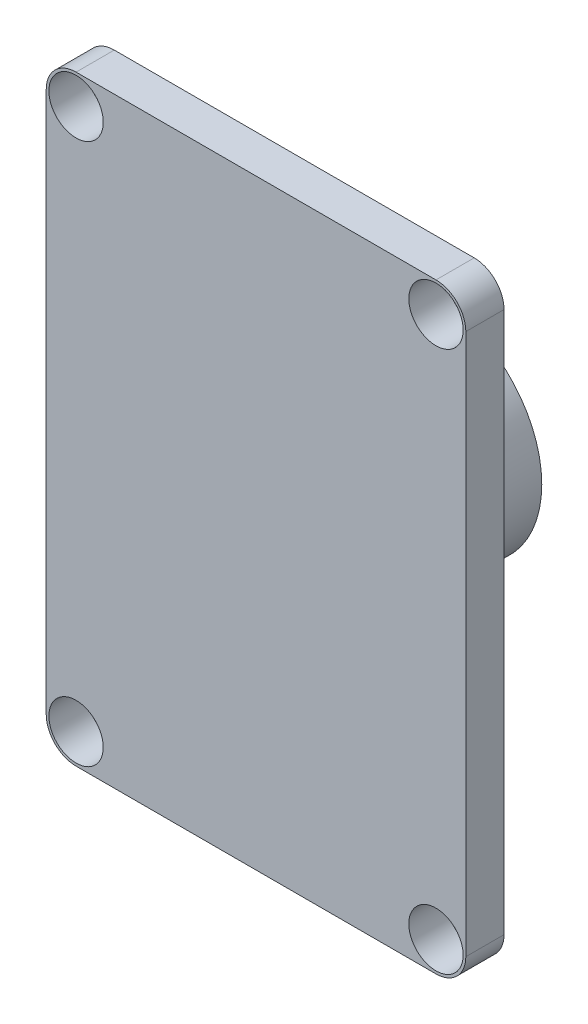
ISO-10303-21;
HEADER;
FILE_DESCRIPTION(('STEP AP214'),'2;1');
FILE_NAME('part.step','',(''),(''),'','','');
FILE_SCHEMA(('AUTOMOTIVE_DESIGN { 1 0 10303 214 1 1 1 1 }'));
ENDSEC;
DATA;
#1=APPLICATION_CONTEXT('core data for automotive mechanical design processes');
#2=APPLICATION_PROTOCOL_DEFINITION('international standard','automotive_design',2000,#1);
#3=PRODUCT_CONTEXT('',#1,'mechanical');
#4=PRODUCT('Part','Part','',(#3));
#5=PRODUCT_RELATED_PRODUCT_CATEGORY('part','',(#4));
#6=PRODUCT_DEFINITION_FORMATION('','',#4);
#7=PRODUCT_DEFINITION_CONTEXT('part definition',#1,'design');
#8=PRODUCT_DEFINITION('design','',#6,#7);
#9=PRODUCT_DEFINITION_SHAPE('','',#8);
#10=(LENGTH_UNIT() NAMED_UNIT(*) SI_UNIT(.MILLI.,.METRE.));
#11=(NAMED_UNIT(*) PLANE_ANGLE_UNIT() SI_UNIT($,.RADIAN.));
#12=(NAMED_UNIT(*) SI_UNIT($,.STERADIAN.) SOLID_ANGLE_UNIT());
#13=UNCERTAINTY_MEASURE_WITH_UNIT(LENGTH_MEASURE(1.E-05),#10,'distance_accuracy_value','');
#14=(GEOMETRIC_REPRESENTATION_CONTEXT(3) GLOBAL_UNCERTAINTY_ASSIGNED_CONTEXT((#13)) GLOBAL_UNIT_ASSIGNED_CONTEXT((#10,
#11,#12)) REPRESENTATION_CONTEXT('',''));
#15=CARTESIAN_POINT('',(0.,0.,0.));
#16=DIRECTION('',(0.,0.,1.));
#17=DIRECTION('',(1.,0.,0.));
#18=AXIS2_PLACEMENT_3D('',#15,#16,#17);
#19=CARTESIAN_POINT('',(-7.6581,-11.5189,1.6256));
#20=DIRECTION('',(0.,0.,-1.));
#21=DIRECTION('',(-1.,0.,0.));
#22=AXIS2_PLACEMENT_3D('',#19,#20,#21);
#23=PLANE('',#22);
#24=CARTESIAN_POINT('',(-7.6581,-11.5189,1.6256));
#25=DIRECTION('',(0.,0.,1.));
#26=DIRECTION('',(-1.,0.,0.));
#27=AXIS2_PLACEMENT_3D('',#24,#25,#26);
#28=CIRCLE('',#27,1.27);
#29=CARTESIAN_POINT('',(-8.9281,-11.5189,1.6256));
#30=VERTEX_POINT('',#29);
#31=CARTESIAN_POINT('',(-7.65809999999999,-12.7889,1.6256));
#32=VERTEX_POINT('',#31);
#33=EDGE_CURVE('E151',#30,#32,#28,.T.);
#34=ORIENTED_EDGE('',*,*,#33,.T.);
#35=DIRECTION('',(1.,0.,0.));
#36=VECTOR('',#35,1.);
#37=CARTESIAN_POINT('',(-7.65809999999999,-12.7889,1.6256));
#38=LINE('',#37,#36);
#39=CARTESIAN_POINT('',(7.65809999999999,-12.7889,1.6256));
#40=VERTEX_POINT('',#39);
#41=EDGE_CURVE('E99',#32,#40,#38,.T.);
#42=ORIENTED_EDGE('',*,*,#41,.T.);
#43=CARTESIAN_POINT('',(7.6581,-11.5189,1.6256));
#44=DIRECTION('',(0.,0.,1.));
#45=DIRECTION('',(-1.,0.,0.));
#46=AXIS2_PLACEMENT_3D('',#43,#44,#45);
#47=CIRCLE('',#46,1.27);
#48=CARTESIAN_POINT('',(8.9281,-11.5189,1.6256));
#49=VERTEX_POINT('',#48);
#50=EDGE_CURVE('E166',#40,#49,#47,.T.);
#51=ORIENTED_EDGE('',*,*,#50,.T.);
#52=DIRECTION('',(0.,1.,0.));
#53=VECTOR('',#52,1.);
#54=CARTESIAN_POINT('',(8.9281,-11.5189,1.6256));
#55=LINE('',#54,#53);
#56=CARTESIAN_POINT('',(8.9281,11.5189,1.6256));
#57=VERTEX_POINT('',#56);
#58=EDGE_CURVE('E179',#49,#57,#55,.T.);
#59=ORIENTED_EDGE('',*,*,#58,.T.);
#60=CARTESIAN_POINT('',(7.6581,11.5189,1.6256));
#61=DIRECTION('',(0.,0.,1.));
#62=DIRECTION('',(1.,0.,0.));
#63=AXIS2_PLACEMENT_3D('',#60,#61,#62);
#64=CIRCLE('',#63,1.27);
#65=CARTESIAN_POINT('',(7.65809999999999,12.7889,1.6256));
#66=VERTEX_POINT('',#65);
#67=EDGE_CURVE('E118',#57,#66,#64,.T.);
#68=ORIENTED_EDGE('',*,*,#67,.T.);
#69=DIRECTION('',(-1.,0.,0.));
#70=VECTOR('',#69,1.);
#71=CARTESIAN_POINT('',(-7.65809999999999,12.7889,1.6256));
#72=LINE('',#71,#70);
#73=CARTESIAN_POINT('',(-7.65809999999999,12.7889,1.6256));
#74=VERTEX_POINT('',#73);
#75=EDGE_CURVE('E112',#66,#74,#72,.T.);
#76=ORIENTED_EDGE('',*,*,#75,.T.);
#77=CARTESIAN_POINT('',(-7.6581,11.5189,1.6256));
#78=DIRECTION('',(0.,0.,1.));
#79=DIRECTION('',(1.,0.,0.));
#80=AXIS2_PLACEMENT_3D('',#77,#78,#79);
#81=CIRCLE('',#80,1.27);
#82=CARTESIAN_POINT('',(-8.9281,11.5189,1.6256));
#83=VERTEX_POINT('',#82);
#84=EDGE_CURVE('E116',#74,#83,#81,.T.);
#85=ORIENTED_EDGE('',*,*,#84,.T.);
#86=DIRECTION('',(0.,-1.,0.));
#87=VECTOR('',#86,1.);
#88=CARTESIAN_POINT('',(-8.9281,-11.5189,1.6256));
#89=LINE('',#88,#87);
#90=EDGE_CURVE('E56',#83,#30,#89,.T.);
#91=ORIENTED_EDGE('',*,*,#90,.T.);
#92=EDGE_LOOP('',(#34,#42,#51,#59,#68,#76,#85,#91));
#93=FACE_BOUND('',#92,.T.);
#94=CARTESIAN_POINT('',(7.6581,11.5189,1.6256));
#95=DIRECTION('',(0.,0.,1.));
#96=DIRECTION('',(1.,0.,0.));
#97=AXIS2_PLACEMENT_3D('',#94,#95,#96);
#98=CIRCLE('',#97,1.15640153633708);
#99=CARTESIAN_POINT('',(8.81450153633708,11.5189,1.6256));
#100=VERTEX_POINT('',#99);
#101=EDGE_CURVE('E140',#100,#100,#98,.T.);
#102=ORIENTED_EDGE('',*,*,#101,.F.);
#103=EDGE_LOOP('',(#102));
#104=FACE_BOUND('',#103,.T.);
#105=CARTESIAN_POINT('',(-7.6581,11.5189,1.6256));
#106=DIRECTION('',(0.,0.,1.));
#107=DIRECTION('',(-1.,0.,0.));
#108=AXIS2_PLACEMENT_3D('',#105,#106,#107);
#109=CIRCLE('',#108,1.15640153633708);
#110=CARTESIAN_POINT('',(-8.81450153633708,11.5189,1.6256));
#111=VERTEX_POINT('',#110);
#112=EDGE_CURVE('E188',#111,#111,#109,.T.);
#113=ORIENTED_EDGE('',*,*,#112,.F.);
#114=EDGE_LOOP('',(#113));
#115=FACE_BOUND('',#114,.T.);
#116=CARTESIAN_POINT('',(7.6581,-11.5189,1.6256));
#117=DIRECTION('',(0.,0.,1.));
#118=DIRECTION('',(-1.,0.,0.));
#119=AXIS2_PLACEMENT_3D('',#116,#117,#118);
#120=CIRCLE('',#119,1.15640153633709);
#121=CARTESIAN_POINT('',(6.50169846366292,-11.5189,1.6256));
#122=VERTEX_POINT('',#121);
#123=EDGE_CURVE('E194',#122,#122,#120,.T.);
#124=ORIENTED_EDGE('',*,*,#123,.F.);
#125=EDGE_LOOP('',(#124));
#126=FACE_BOUND('',#125,.T.);
#127=CARTESIAN_POINT('',(-7.6581,-11.5189,1.6256));
#128=DIRECTION('',(0.,0.,1.));
#129=DIRECTION('',(1.,0.,0.));
#130=AXIS2_PLACEMENT_3D('',#127,#128,#129);
#131=CIRCLE('',#130,1.15640153633708);
#132=CARTESIAN_POINT('',(-6.50169846366291,-11.5189,1.6256));
#133=VERTEX_POINT('',#132);
#134=EDGE_CURVE('E200',#133,#133,#131,.T.);
#135=ORIENTED_EDGE('',*,*,#134,.F.);
#136=EDGE_LOOP('',(#135));
#137=FACE_BOUND('',#136,.T.);
#138=ADVANCED_FACE('F39',(#93,#104,#115,#126,#137),#23,.F.);
#139=CARTESIAN_POINT('',(-7.6581,-11.5189,0.));
#140=DIRECTION('',(0.,0.,-1.));
#141=DIRECTION('',(-1.,0.,0.));
#142=AXIS2_PLACEMENT_3D('',#139,#140,#141);
#143=PLANE('',#142);
#144=CARTESIAN_POINT('',(0.,0.,0.));
#145=DIRECTION('',(0.,0.,-1.));
#146=DIRECTION('',(-1.,0.,0.));
#147=AXIS2_PLACEMENT_3D('',#144,#145,#146);
#148=CIRCLE('',#147,4.65455);
#149=CARTESIAN_POINT('',(-4.65455,0.,0.));
#150=VERTEX_POINT('',#149);
#151=EDGE_CURVE('E209',#150,#150,#148,.T.);
#152=ORIENTED_EDGE('',*,*,#151,.F.);
#153=EDGE_LOOP('',(#152));
#154=FACE_BOUND('',#153,.T.);
#155=CARTESIAN_POINT('',(7.6581,-11.5189,0.));
#156=DIRECTION('',(0.,0.,1.));
#157=DIRECTION('',(-1.,0.,0.));
#158=AXIS2_PLACEMENT_3D('',#155,#156,#157);
#159=CIRCLE('',#158,1.15640153633709);
#160=CARTESIAN_POINT('',(6.50169846366292,-11.5189,0.));
#161=VERTEX_POINT('',#160);
#162=EDGE_CURVE('E197',#161,#161,#159,.T.);
#163=ORIENTED_EDGE('',*,*,#162,.T.);
#164=EDGE_LOOP('',(#163));
#165=FACE_BOUND('',#164,.T.);
#166=CARTESIAN_POINT('',(7.6581,11.5189,0.));
#167=DIRECTION('',(0.,0.,1.));
#168=DIRECTION('',(1.,0.,0.));
#169=AXIS2_PLACEMENT_3D('',#166,#167,#168);
#170=CIRCLE('',#169,1.15640153633708);
#171=CARTESIAN_POINT('',(8.81450153633708,11.5189,0.));
#172=VERTEX_POINT('',#171);
#173=EDGE_CURVE('E185',#172,#172,#170,.T.);
#174=ORIENTED_EDGE('',*,*,#173,.T.);
#175=EDGE_LOOP('',(#174));
#176=FACE_BOUND('',#175,.T.);
#177=CARTESIAN_POINT('',(-7.6581,-11.5189,0.));
#178=DIRECTION('',(0.,0.,1.));
#179=DIRECTION('',(-1.,0.,0.));
#180=AXIS2_PLACEMENT_3D('',#177,#178,#179);
#181=CIRCLE('',#180,1.27);
#182=CARTESIAN_POINT('',(-8.9281,-11.5189,0.));
#183=VERTEX_POINT('',#182);
#184=CARTESIAN_POINT('',(-7.65809999999999,-12.7889,0.));
#185=VERTEX_POINT('',#184);
#186=EDGE_CURVE('E136',#183,#185,#181,.T.);
#187=ORIENTED_EDGE('',*,*,#186,.F.);
#188=DIRECTION('',(0.,-1.,0.));
#189=VECTOR('',#188,1.);
#190=CARTESIAN_POINT('',(-8.9281,-11.5189,0.));
#191=LINE('',#190,#189);
#192=CARTESIAN_POINT('',(-8.9281,11.5189,0.));
#193=VERTEX_POINT('',#192);
#194=EDGE_CURVE('E91',#193,#183,#191,.T.);
#195=ORIENTED_EDGE('',*,*,#194,.F.);
#196=CARTESIAN_POINT('',(-7.6581,11.5189,0.));
#197=DIRECTION('',(0.,0.,1.));
#198=DIRECTION('',(1.,0.,0.));
#199=AXIS2_PLACEMENT_3D('',#196,#197,#198);
#200=CIRCLE('',#199,1.27);
#201=CARTESIAN_POINT('',(-7.65809999999999,12.7889,0.));
#202=VERTEX_POINT('',#201);
#203=EDGE_CURVE('E85',#202,#193,#200,.T.);
#204=ORIENTED_EDGE('',*,*,#203,.F.);
#205=DIRECTION('',(-1.,0.,0.));
#206=VECTOR('',#205,1.);
#207=CARTESIAN_POINT('',(-7.65809999999999,12.7889,0.));
#208=LINE('',#207,#206);
#209=CARTESIAN_POINT('',(7.65809999999999,12.7889,0.));
#210=VERTEX_POINT('',#209);
#211=EDGE_CURVE('E126',#210,#202,#208,.T.);
#212=ORIENTED_EDGE('',*,*,#211,.F.);
#213=CARTESIAN_POINT('',(7.6581,11.5189,0.));
#214=DIRECTION('',(0.,0.,1.));
#215=DIRECTION('',(1.,0.,0.));
#216=AXIS2_PLACEMENT_3D('',#213,#214,#215);
#217=CIRCLE('',#216,1.27);
#218=CARTESIAN_POINT('',(8.9281,11.5189,0.));
#219=VERTEX_POINT('',#218);
#220=EDGE_CURVE('E146',#219,#210,#217,.T.);
#221=ORIENTED_EDGE('',*,*,#220,.F.);
#222=DIRECTION('',(0.,1.,0.));
#223=VECTOR('',#222,1.);
#224=CARTESIAN_POINT('',(8.9281,-11.5189,0.));
#225=LINE('',#224,#223);
#226=CARTESIAN_POINT('',(8.9281,-11.5189,0.));
#227=VERTEX_POINT('',#226);
#228=EDGE_CURVE('E144',#227,#219,#225,.T.);
#229=ORIENTED_EDGE('',*,*,#228,.F.);
#230=CARTESIAN_POINT('',(7.6581,-11.5189,0.));
#231=DIRECTION('',(0.,0.,1.));
#232=DIRECTION('',(-1.,0.,0.));
#233=AXIS2_PLACEMENT_3D('',#230,#231,#232);
#234=CIRCLE('',#233,1.27);
#235=CARTESIAN_POINT('',(7.65809999999999,-12.7889,0.));
#236=VERTEX_POINT('',#235);
#237=EDGE_CURVE('E142',#236,#227,#234,.T.);
#238=ORIENTED_EDGE('',*,*,#237,.F.);
#239=DIRECTION('',(1.,0.,0.));
#240=VECTOR('',#239,1.);
#241=CARTESIAN_POINT('',(-7.65809999999999,-12.7889,0.));
#242=LINE('',#241,#240);
#243=EDGE_CURVE('E139',#185,#236,#242,.T.);
#244=ORIENTED_EDGE('',*,*,#243,.F.);
#245=EDGE_LOOP('',(#187,#195,#204,#212,#221,#229,#238,#244));
#246=FACE_BOUND('',#245,.T.);
#247=CARTESIAN_POINT('',(-7.6581,11.5189,0.));
#248=DIRECTION('',(0.,0.,1.));
#249=DIRECTION('',(-1.,0.,0.));
#250=AXIS2_PLACEMENT_3D('',#247,#248,#249);
#251=CIRCLE('',#250,1.15640153633708);
#252=CARTESIAN_POINT('',(-8.81450153633708,11.5189,0.));
#253=VERTEX_POINT('',#252);
#254=EDGE_CURVE('E191',#253,#253,#251,.T.);
#255=ORIENTED_EDGE('',*,*,#254,.T.);
#256=EDGE_LOOP('',(#255));
#257=FACE_BOUND('',#256,.T.);
#258=CARTESIAN_POINT('',(-7.6581,-11.5189,0.));
#259=DIRECTION('',(0.,0.,1.));
#260=DIRECTION('',(1.,0.,0.));
#261=AXIS2_PLACEMENT_3D('',#258,#259,#260);
#262=CIRCLE('',#261,1.15640153633708);
#263=CARTESIAN_POINT('',(-6.50169846366291,-11.5189,0.));
#264=VERTEX_POINT('',#263);
#265=EDGE_CURVE('E203',#264,#264,#262,.T.);
#266=ORIENTED_EDGE('',*,*,#265,.T.);
#267=EDGE_LOOP('',(#266));
#268=FACE_BOUND('',#267,.T.);
#269=ADVANCED_FACE('F170',(#154,#165,#176,#246,#257,#268),#143,.T.);
#270=CARTESIAN_POINT('',(-7.6581,-11.5189,1.6256));
#271=DIRECTION('',(0.,0.,-1.));
#272=DIRECTION('',(-1.,0.,0.));
#273=AXIS2_PLACEMENT_3D('',#270,#271,#272);
#274=CYLINDRICAL_SURFACE('',#273,1.27);
#275=ORIENTED_EDGE('',*,*,#186,.T.);
#276=DIRECTION('',(0.,0.,-1.));
#277=VECTOR('',#276,1.);
#278=CARTESIAN_POINT('',(-7.65809999999999,-12.7889,1.6256));
#279=LINE('',#278,#277);
#280=EDGE_CURVE('E11',#32,#185,#279,.T.);
#281=ORIENTED_EDGE('',*,*,#280,.F.);
#282=ORIENTED_EDGE('',*,*,#33,.F.);
#283=DIRECTION('',(0.,0.,-1.));
#284=VECTOR('',#283,1.);
#285=CARTESIAN_POINT('',(-8.9281,-11.5189,1.6256));
#286=LINE('',#285,#284);
#287=EDGE_CURVE('E132',#30,#183,#286,.T.);
#288=ORIENTED_EDGE('',*,*,#287,.T.);
#289=EDGE_LOOP('',(#275,#281,#282,#288));
#290=FACE_BOUND('',#289,.T.);
#291=ADVANCED_FACE('F41',(#290),#274,.T.);
#292=CARTESIAN_POINT('',(-7.65809999999999,-12.7889,1.6256));
#293=DIRECTION('',(0.,1.,0.));
#294=DIRECTION('',(0.,0.,1.));
#295=AXIS2_PLACEMENT_3D('',#292,#293,#294);
#296=PLANE('',#295);
#297=ORIENTED_EDGE('',*,*,#243,.T.);
#298=DIRECTION('',(0.,0.,-1.));
#299=VECTOR('',#298,1.);
#300=CARTESIAN_POINT('',(7.65809999999999,-12.7889,1.6256));
#301=LINE('',#300,#299);
#302=EDGE_CURVE('E48',#40,#236,#301,.T.);
#303=ORIENTED_EDGE('',*,*,#302,.F.);
#304=ORIENTED_EDGE('',*,*,#41,.F.);
#305=ORIENTED_EDGE('',*,*,#280,.T.);
#306=EDGE_LOOP('',(#297,#303,#304,#305));
#307=FACE_BOUND('',#306,.T.);
#308=ADVANCED_FACE('F260',(#307),#296,.F.);
#309=CARTESIAN_POINT('',(7.6581,-11.5189,1.6256));
#310=DIRECTION('',(0.,0.,-1.));
#311=DIRECTION('',(-1.,0.,0.));
#312=AXIS2_PLACEMENT_3D('',#309,#310,#311);
#313=CYLINDRICAL_SURFACE('',#312,1.27);
#314=ORIENTED_EDGE('',*,*,#237,.T.);
#315=DIRECTION('',(0.,0.,-1.));
#316=VECTOR('',#315,1.);
#317=CARTESIAN_POINT('',(8.9281,-11.5189,1.6256));
#318=LINE('',#317,#316);
#319=EDGE_CURVE('E158',#49,#227,#318,.T.);
#320=ORIENTED_EDGE('',*,*,#319,.F.);
#321=ORIENTED_EDGE('',*,*,#50,.F.);
#322=ORIENTED_EDGE('',*,*,#302,.T.);
#323=EDGE_LOOP('',(#314,#320,#321,#322));
#324=FACE_BOUND('',#323,.T.);
#325=ADVANCED_FACE('F164',(#324),#313,.T.);
#326=CARTESIAN_POINT('',(8.9281,-11.5189,1.6256));
#327=DIRECTION('',(-1.,0.,0.));
#328=DIRECTION('',(0.,0.,1.));
#329=AXIS2_PLACEMENT_3D('',#326,#327,#328);
#330=PLANE('',#329);
#331=ORIENTED_EDGE('',*,*,#228,.T.);
#332=DIRECTION('',(0.,0.,-1.));
#333=VECTOR('',#332,1.);
#334=CARTESIAN_POINT('',(8.9281,11.5189,1.6256));
#335=LINE('',#334,#333);
#336=EDGE_CURVE('E155',#57,#219,#335,.T.);
#337=ORIENTED_EDGE('',*,*,#336,.F.);
#338=ORIENTED_EDGE('',*,*,#58,.F.);
#339=ORIENTED_EDGE('',*,*,#319,.T.);
#340=EDGE_LOOP('',(#331,#337,#338,#339));
#341=FACE_BOUND('',#340,.T.);
#342=ADVANCED_FACE('F175',(#341),#330,.F.);
#343=CARTESIAN_POINT('',(7.6581,11.5189,1.6256));
#344=DIRECTION('',(0.,0.,-1.));
#345=DIRECTION('',(-1.,0.,0.));
#346=AXIS2_PLACEMENT_3D('',#343,#344,#345);
#347=CYLINDRICAL_SURFACE('',#346,1.27);
#348=ORIENTED_EDGE('',*,*,#220,.T.);
#349=DIRECTION('',(0.,0.,-1.));
#350=VECTOR('',#349,1.);
#351=CARTESIAN_POINT('',(7.65809999999999,12.7889,1.6256));
#352=LINE('',#351,#350);
#353=EDGE_CURVE('E127',#66,#210,#352,.T.);
#354=ORIENTED_EDGE('',*,*,#353,.F.);
#355=ORIENTED_EDGE('',*,*,#67,.F.);
#356=ORIENTED_EDGE('',*,*,#336,.T.);
#357=EDGE_LOOP('',(#348,#354,#355,#356));
#358=FACE_BOUND('',#357,.T.);
#359=ADVANCED_FACE('F178',(#358),#347,.T.);
#360=CARTESIAN_POINT('',(-7.65809999999999,12.7889,1.6256));
#361=DIRECTION('',(0.,-1.,0.));
#362=DIRECTION('',(0.,0.,-1.));
#363=AXIS2_PLACEMENT_3D('',#360,#361,#362);
#364=PLANE('',#363);
#365=ORIENTED_EDGE('',*,*,#211,.T.);
#366=DIRECTION('',(0.,0.,-1.));
#367=VECTOR('',#366,1.);
#368=CARTESIAN_POINT('',(-7.65809999999999,12.7889,1.6256));
#369=LINE('',#368,#367);
#370=EDGE_CURVE('E123',#74,#202,#369,.T.);
#371=ORIENTED_EDGE('',*,*,#370,.F.);
#372=ORIENTED_EDGE('',*,*,#75,.F.);
#373=ORIENTED_EDGE('',*,*,#353,.T.);
#374=EDGE_LOOP('',(#365,#371,#372,#373));
#375=FACE_BOUND('',#374,.T.);
#376=ADVANCED_FACE('F124',(#375),#364,.F.);
#377=CARTESIAN_POINT('',(-7.6581,11.5189,1.6256));
#378=DIRECTION('',(0.,0.,-1.));
#379=DIRECTION('',(-1.,0.,0.));
#380=AXIS2_PLACEMENT_3D('',#377,#378,#379);
#381=CYLINDRICAL_SURFACE('',#380,1.27);
#382=ORIENTED_EDGE('',*,*,#203,.T.);
#383=DIRECTION('',(0.,0.,-1.));
#384=VECTOR('',#383,1.);
#385=CARTESIAN_POINT('',(-8.9281,11.5189,1.6256));
#386=LINE('',#385,#384);
#387=EDGE_CURVE('E128',#83,#193,#386,.T.);
#388=ORIENTED_EDGE('',*,*,#387,.F.);
#389=ORIENTED_EDGE('',*,*,#84,.F.);
#390=ORIENTED_EDGE('',*,*,#370,.T.);
#391=EDGE_LOOP('',(#382,#388,#389,#390));
#392=FACE_BOUND('',#391,.T.);
#393=ADVANCED_FACE('F130',(#392),#381,.T.);
#394=CARTESIAN_POINT('',(-8.9281,-11.5189,1.6256));
#395=DIRECTION('',(1.,0.,0.));
#396=DIRECTION('',(0.,0.,-1.));
#397=AXIS2_PLACEMENT_3D('',#394,#395,#396);
#398=PLANE('',#397);
#399=ORIENTED_EDGE('',*,*,#194,.T.);
#400=ORIENTED_EDGE('',*,*,#287,.F.);
#401=ORIENTED_EDGE('',*,*,#90,.F.);
#402=ORIENTED_EDGE('',*,*,#387,.T.);
#403=EDGE_LOOP('',(#399,#400,#401,#402));
#404=FACE_BOUND('',#403,.T.);
#405=ADVANCED_FACE('F234',(#404),#398,.F.);
#406=CARTESIAN_POINT('',(7.6581,11.5189,1.6256));
#407=DIRECTION('',(0.,0.,-1.));
#408=DIRECTION('',(-1.,0.,0.));
#409=AXIS2_PLACEMENT_3D('',#406,#407,#408);
#410=CYLINDRICAL_SURFACE('',#409,1.15640153633708);
#411=ORIENTED_EDGE('',*,*,#101,.T.);
#412=EDGE_LOOP('',(#411));
#413=FACE_BOUND('',#412,.T.);
#414=ORIENTED_EDGE('',*,*,#173,.F.);
#415=EDGE_LOOP('',(#414));
#416=FACE_BOUND('',#415,.T.);
#417=ADVANCED_FACE('F231',(#413,#416),#410,.F.);
#418=CARTESIAN_POINT('',(-7.6581,11.5189,1.6256));
#419=DIRECTION('',(0.,0.,-1.));
#420=DIRECTION('',(-1.,0.,0.));
#421=AXIS2_PLACEMENT_3D('',#418,#419,#420);
#422=CYLINDRICAL_SURFACE('',#421,1.15640153633708);
#423=ORIENTED_EDGE('',*,*,#112,.T.);
#424=EDGE_LOOP('',(#423));
#425=FACE_BOUND('',#424,.T.);
#426=ORIENTED_EDGE('',*,*,#254,.F.);
#427=EDGE_LOOP('',(#426));
#428=FACE_BOUND('',#427,.T.);
#429=ADVANCED_FACE('F233',(#425,#428),#422,.F.);
#430=CARTESIAN_POINT('',(7.6581,-11.5189,1.6256));
#431=DIRECTION('',(0.,0.,-1.));
#432=DIRECTION('',(-1.,0.,0.));
#433=AXIS2_PLACEMENT_3D('',#430,#431,#432);
#434=CYLINDRICAL_SURFACE('',#433,1.15640153633709);
#435=ORIENTED_EDGE('',*,*,#123,.T.);
#436=EDGE_LOOP('',(#435));
#437=FACE_BOUND('',#436,.T.);
#438=ORIENTED_EDGE('',*,*,#162,.F.);
#439=EDGE_LOOP('',(#438));
#440=FACE_BOUND('',#439,.T.);
#441=ADVANCED_FACE('F241',(#437,#440),#434,.F.);
#442=CARTESIAN_POINT('',(-7.6581,-11.5189,1.6256));
#443=DIRECTION('',(0.,0.,-1.));
#444=DIRECTION('',(-1.,0.,0.));
#445=AXIS2_PLACEMENT_3D('',#442,#443,#444);
#446=CYLINDRICAL_SURFACE('',#445,1.15640153633708);
#447=ORIENTED_EDGE('',*,*,#134,.T.);
#448=EDGE_LOOP('',(#447));
#449=FACE_BOUND('',#448,.T.);
#450=ORIENTED_EDGE('',*,*,#265,.F.);
#451=EDGE_LOOP('',(#450));
#452=FACE_BOUND('',#451,.T.);
#453=ADVANCED_FACE('F220',(#449,#452),#446,.F.);
#454=CARTESIAN_POINT('',(0.,0.,-5.8801));
#455=DIRECTION('',(0.,0.,1.));
#456=DIRECTION('',(1.,0.,0.));
#457=AXIS2_PLACEMENT_3D('',#454,#455,#456);
#458=CYLINDRICAL_SURFACE('',#457,4.65455);
#459=CARTESIAN_POINT('',(0.,0.,-5.8801));
#460=DIRECTION('',(0.,0.,-1.));
#461=DIRECTION('',(-1.,0.,0.));
#462=AXIS2_PLACEMENT_3D('',#459,#460,#461);
#463=CIRCLE('',#462,4.65455);
#464=CARTESIAN_POINT('',(-4.65455,0.,-5.8801));
#465=VERTEX_POINT('',#464);
#466=EDGE_CURVE('E206',#465,#465,#463,.T.);
#467=ORIENTED_EDGE('',*,*,#466,.F.);
#468=EDGE_LOOP('',(#467));
#469=FACE_BOUND('',#468,.T.);
#470=ORIENTED_EDGE('',*,*,#151,.T.);
#471=EDGE_LOOP('',(#470));
#472=FACE_BOUND('',#471,.T.);
#473=ADVANCED_FACE('F217',(#469,#472),#458,.T.);
#474=CARTESIAN_POINT('',(0.,0.,-5.8801));
#475=DIRECTION('',(0.,0.,-1.));
#476=DIRECTION('',(-1.,0.,0.));
#477=AXIS2_PLACEMENT_3D('',#474,#475,#476);
#478=PLANE('',#477);
#479=ORIENTED_EDGE('',*,*,#466,.T.);
#480=EDGE_LOOP('',(#479));
#481=FACE_BOUND('',#480,.T.);
#482=ADVANCED_FACE('F215',(#481),#478,.T.);
#483=CLOSED_SHELL('',(#138,#269,#291,#308,#325,#342,#359,#376,#393,#405,#417,#429,#441,#453,
#473,#482));
#484=MANIFOLD_SOLID_BREP('B2',#483);
#485=ADVANCED_BREP_SHAPE_REPRESENTATION('',(#18,#484),#14);
#486=SHAPE_DEFINITION_REPRESENTATION(#9,#485);
ENDSEC;
END-ISO-10303-21;
